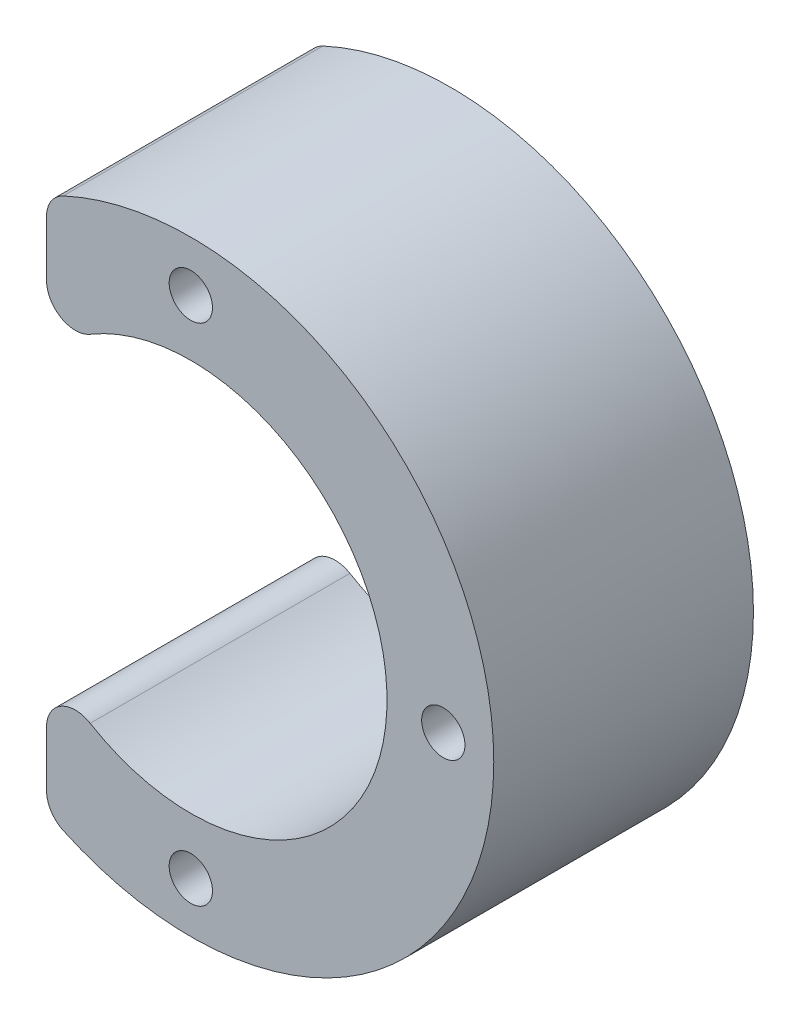
ISO-10303-21;
HEADER;
FILE_DESCRIPTION(('STEP AP214'),'2;1');
FILE_NAME('part.step','',(''),(''),'','','');
FILE_SCHEMA(('AUTOMOTIVE_DESIGN { 1 0 10303 214 1 1 1 1 }'));
ENDSEC;
DATA;
#1=APPLICATION_CONTEXT('core data for automotive mechanical design processes');
#2=APPLICATION_PROTOCOL_DEFINITION('international standard','automotive_design',2000,#1);
#3=PRODUCT_CONTEXT('',#1,'mechanical');
#4=PRODUCT('Part','Part','',(#3));
#5=PRODUCT_RELATED_PRODUCT_CATEGORY('part','',(#4));
#6=PRODUCT_DEFINITION_FORMATION('','',#4);
#7=PRODUCT_DEFINITION_CONTEXT('part definition',#1,'design');
#8=PRODUCT_DEFINITION('design','',#6,#7);
#9=PRODUCT_DEFINITION_SHAPE('','',#8);
#10=(LENGTH_UNIT() NAMED_UNIT(*) SI_UNIT(.MILLI.,.METRE.));
#11=(NAMED_UNIT(*) PLANE_ANGLE_UNIT() SI_UNIT($,.RADIAN.));
#12=(NAMED_UNIT(*) SI_UNIT($,.STERADIAN.) SOLID_ANGLE_UNIT());
#13=UNCERTAINTY_MEASURE_WITH_UNIT(LENGTH_MEASURE(1.E-05),#10,'distance_accuracy_value','');
#14=(GEOMETRIC_REPRESENTATION_CONTEXT(3) GLOBAL_UNCERTAINTY_ASSIGNED_CONTEXT((#13)) GLOBAL_UNIT_ASSIGNED_CONTEXT((#10,
#11,#12)) REPRESENTATION_CONTEXT('',''));
#15=CARTESIAN_POINT('',(0.,0.,0.));
#16=DIRECTION('',(0.,0.,1.));
#17=DIRECTION('',(1.,0.,0.));
#18=AXIS2_PLACEMENT_3D('',#15,#16,#17);
#19=CARTESIAN_POINT('',(0.,0.,18.));
#20=DIRECTION('',(0.,0.,-1.));
#21=DIRECTION('',(-1.,0.,0.));
#22=AXIS2_PLACEMENT_3D('',#19,#20,#21);
#23=CYLINDRICAL_SURFACE('',#22,21.);
#24=CARTESIAN_POINT('',(0.,0.,0.));
#25=DIRECTION('',(0.,0.,1.));
#26=DIRECTION('',(1.,0.,0.));
#27=AXIS2_PLACEMENT_3D('',#24,#25,#26);
#28=CIRCLE('',#27,21.);
#29=CARTESIAN_POINT('',(-8.8421052631579,-19.0477603543103,0.));
#30=VERTEX_POINT('',#29);
#31=CARTESIAN_POINT('',(-8.84210526315789,19.0477603543103,0.));
#32=VERTEX_POINT('',#31);
#33=EDGE_CURVE('E157',#30,#32,#28,.T.);
#34=ORIENTED_EDGE('',*,*,#33,.T.);
#35=DIRECTION('',(0.,0.,-1.));
#36=VECTOR('',#35,1.);
#37=CARTESIAN_POINT('',(-8.8421052631579,19.0477603543103,18.));
#38=LINE('',#37,#36);
#39=CARTESIAN_POINT('',(-8.84210526315789,19.0477603543103,18.));
#40=VERTEX_POINT('',#39);
#41=EDGE_CURVE('E129',#32,#40,#38,.F.);
#42=ORIENTED_EDGE('',*,*,#41,.T.);
#43=CARTESIAN_POINT('',(0.,0.,18.));
#44=DIRECTION('',(0.,0.,1.));
#45=DIRECTION('',(1.,0.,0.));
#46=AXIS2_PLACEMENT_3D('',#43,#44,#45);
#47=CIRCLE('',#46,21.);
#48=CARTESIAN_POINT('',(-8.8421052631579,-19.0477603543103,18.));
#49=VERTEX_POINT('',#48);
#50=EDGE_CURVE('E114',#49,#40,#47,.T.);
#51=ORIENTED_EDGE('',*,*,#50,.F.);
#52=DIRECTION('',(0.,0.,-1.));
#53=VECTOR('',#52,1.);
#54=CARTESIAN_POINT('',(-8.8421052631579,-19.0477603543103,18.));
#55=LINE('',#54,#53);
#56=EDGE_CURVE('E177',#49,#30,#55,.T.);
#57=ORIENTED_EDGE('',*,*,#56,.T.);
#58=EDGE_LOOP('',(#34,#42,#51,#57));
#59=FACE_BOUND('',#58,.T.);
#60=ADVANCED_FACE('F36',(#59),#23,.T.);
#61=CARTESIAN_POINT('',(0.,0.,18.));
#62=DIRECTION('',(0.,0.,1.));
#63=DIRECTION('',(1.,0.,0.));
#64=AXIS2_PLACEMENT_3D('',#61,#62,#63);
#65=PLANE('',#64);
#66=ORIENTED_EDGE('',*,*,#50,.T.);
#67=CARTESIAN_POINT('',(-8.,17.2336879396141,18.));
#68=DIRECTION('',(0.,0.,1.));
#69=DIRECTION('',(1.,0.,0.));
#70=AXIS2_PLACEMENT_3D('',#67,#68,#69);
#71=CIRCLE('',#70,2.);
#72=CARTESIAN_POINT('',(-10.,17.2336879396141,18.));
#73=VERTEX_POINT('',#72);
#74=EDGE_CURVE('E120',#40,#73,#71,.T.);
#75=ORIENTED_EDGE('',*,*,#74,.T.);
#76=DIRECTION('',(0.,1.,0.));
#77=VECTOR('',#76,1.);
#78=CARTESIAN_POINT('',(-10.,0.,18.));
#79=LINE('',#78,#77);
#80=CARTESIAN_POINT('',(-10.,13.3925352342266,18.));
#81=VERTEX_POINT('',#80);
#82=EDGE_CURVE('E108',#81,#73,#79,.T.);
#83=ORIENTED_EDGE('',*,*,#82,.F.);
#84=CARTESIAN_POINT('',(-8.,13.3925352342266,18.));
#85=DIRECTION('',(0.,0.,1.));
#86=DIRECTION('',(1.,0.,0.));
#87=AXIS2_PLACEMENT_3D('',#84,#85,#86);
#88=CIRCLE('',#87,2.);
#89=CARTESIAN_POINT('',(-6.97435897435897,11.6755435375309,18.));
#90=VERTEX_POINT('',#89);
#91=EDGE_CURVE('E51',#81,#90,#88,.T.);
#92=ORIENTED_EDGE('',*,*,#91,.T.);
#93=CARTESIAN_POINT('',(0.,0.,18.));
#94=DIRECTION('',(0.,0.,1.));
#95=DIRECTION('',(1.,0.,0.));
#96=AXIS2_PLACEMENT_3D('',#93,#94,#95);
#97=CIRCLE('',#96,13.6);
#98=CARTESIAN_POINT('',(-6.97435897435898,-11.6755435375308,18.));
#99=VERTEX_POINT('',#98);
#100=EDGE_CURVE('E140',#99,#90,#97,.T.);
#101=ORIENTED_EDGE('',*,*,#100,.F.);
#102=CARTESIAN_POINT('',(-8.,-13.3925352342266,18.));
#103=DIRECTION('',(0.,0.,1.));
#104=DIRECTION('',(1.,0.,0.));
#105=AXIS2_PLACEMENT_3D('',#102,#103,#104);
#106=CIRCLE('',#105,2.);
#107=CARTESIAN_POINT('',(-10.,-13.3925352342266,18.));
#108=VERTEX_POINT('',#107);
#109=EDGE_CURVE('E59',#99,#108,#106,.T.);
#110=ORIENTED_EDGE('',*,*,#109,.T.);
#111=CARTESIAN_POINT('',(-10.,-17.2336879396141,18.));
#112=VERTEX_POINT('',#111);
#113=EDGE_CURVE('E122',#112,#108,#79,.T.);
#114=ORIENTED_EDGE('',*,*,#113,.F.);
#115=CARTESIAN_POINT('',(-8.,-17.2336879396141,18.));
#116=DIRECTION('',(0.,0.,1.));
#117=DIRECTION('',(1.,0.,0.));
#118=AXIS2_PLACEMENT_3D('',#115,#116,#117);
#119=CIRCLE('',#118,2.);
#120=EDGE_CURVE('E126',#112,#49,#119,.T.);
#121=ORIENTED_EDGE('',*,*,#120,.T.);
#122=EDGE_LOOP('',(#66,#75,#83,#92,#101,#110,#114,#121));
#123=FACE_BOUND('',#122,.T.);
#124=CARTESIAN_POINT('',(-1.19118001678123E-13,-17.5,18.));
#125=DIRECTION('',(0.,0.,1.));
#126=DIRECTION('',(1.,0.,0.));
#127=AXIS2_PLACEMENT_3D('',#124,#125,#126);
#128=CIRCLE('',#127,1.5);
#129=CARTESIAN_POINT('',(1.49999999999988,-17.5,18.));
#130=VERTEX_POINT('',#129);
#131=EDGE_CURVE('E121',#130,#130,#128,.T.);
#132=ORIENTED_EDGE('',*,*,#131,.F.);
#133=EDGE_LOOP('',(#132));
#134=FACE_BOUND('',#133,.T.);
#135=CARTESIAN_POINT('',(17.5,0.,18.));
#136=DIRECTION('',(0.,0.,1.));
#137=DIRECTION('',(1.,0.,0.));
#138=AXIS2_PLACEMENT_3D('',#135,#136,#137);
#139=CIRCLE('',#138,1.5);
#140=CARTESIAN_POINT('',(19.,0.,18.));
#141=VERTEX_POINT('',#140);
#142=EDGE_CURVE('E151',#141,#141,#139,.T.);
#143=ORIENTED_EDGE('',*,*,#142,.F.);
#144=EDGE_LOOP('',(#143));
#145=FACE_BOUND('',#144,.T.);
#146=CARTESIAN_POINT('',(0.,17.5,18.));
#147=DIRECTION('',(0.,0.,1.));
#148=DIRECTION('',(1.,0.,0.));
#149=AXIS2_PLACEMENT_3D('',#146,#147,#148);
#150=CIRCLE('',#149,1.5);
#151=CARTESIAN_POINT('',(1.49999999999999,17.5,18.));
#152=VERTEX_POINT('',#151);
#153=EDGE_CURVE('E146',#152,#152,#150,.T.);
#154=ORIENTED_EDGE('',*,*,#153,.F.);
#155=EDGE_LOOP('',(#154));
#156=FACE_BOUND('',#155,.T.);
#157=ADVANCED_FACE('F117',(#123,#134,#145,#156),#65,.T.);
#158=CARTESIAN_POINT('',(0.,0.,0.));
#159=DIRECTION('',(0.,0.,1.));
#160=DIRECTION('',(1.,0.,0.));
#161=AXIS2_PLACEMENT_3D('',#158,#159,#160);
#162=PLANE('',#161);
#163=CARTESIAN_POINT('',(-1.19118001678123E-13,-17.5,0.));
#164=DIRECTION('',(0.,0.,1.));
#165=DIRECTION('',(1.,0.,0.));
#166=AXIS2_PLACEMENT_3D('',#163,#164,#165);
#167=CIRCLE('',#166,1.5);
#168=CARTESIAN_POINT('',(1.49999999999988,-17.5,0.));
#169=VERTEX_POINT('',#168);
#170=EDGE_CURVE('E159',#169,#169,#167,.T.);
#171=ORIENTED_EDGE('',*,*,#170,.T.);
#172=EDGE_LOOP('',(#171));
#173=FACE_BOUND('',#172,.T.);
#174=CARTESIAN_POINT('',(17.5,0.,0.));
#175=DIRECTION('',(0.,0.,1.));
#176=DIRECTION('',(1.,0.,0.));
#177=AXIS2_PLACEMENT_3D('',#174,#175,#176);
#178=CIRCLE('',#177,1.5);
#179=CARTESIAN_POINT('',(19.,0.,0.));
#180=VERTEX_POINT('',#179);
#181=EDGE_CURVE('E163',#180,#180,#178,.T.);
#182=ORIENTED_EDGE('',*,*,#181,.T.);
#183=EDGE_LOOP('',(#182));
#184=FACE_BOUND('',#183,.T.);
#185=CARTESIAN_POINT('',(0.,17.5,0.));
#186=DIRECTION('',(0.,0.,1.));
#187=DIRECTION('',(1.,0.,0.));
#188=AXIS2_PLACEMENT_3D('',#185,#186,#187);
#189=CIRCLE('',#188,1.5);
#190=CARTESIAN_POINT('',(1.49999999999999,17.5,0.));
#191=VERTEX_POINT('',#190);
#192=EDGE_CURVE('E148',#191,#191,#189,.T.);
#193=ORIENTED_EDGE('',*,*,#192,.T.);
#194=EDGE_LOOP('',(#193));
#195=FACE_BOUND('',#194,.T.);
#196=DIRECTION('',(0.,-1.,0.));
#197=VECTOR('',#196,1.);
#198=CARTESIAN_POINT('',(-10.,18.4661853126194,0.));
#199=LINE('',#198,#197);
#200=CARTESIAN_POINT('',(-10.,17.2336879396141,0.));
#201=VERTEX_POINT('',#200);
#202=CARTESIAN_POINT('',(-10.,13.3925352342266,0.));
#203=VERTEX_POINT('',#202);
#204=EDGE_CURVE('E111',#201,#203,#199,.T.);
#205=ORIENTED_EDGE('',*,*,#204,.F.);
#206=CARTESIAN_POINT('',(-8.,17.2336879396141,0.));
#207=DIRECTION('',(0.,0.,1.));
#208=DIRECTION('',(1.,0.,0.));
#209=AXIS2_PLACEMENT_3D('',#206,#207,#208);
#210=CIRCLE('',#209,2.);
#211=EDGE_CURVE('E175',#201,#32,#210,.F.);
#212=ORIENTED_EDGE('',*,*,#211,.T.);
#213=ORIENTED_EDGE('',*,*,#33,.F.);
#214=CARTESIAN_POINT('',(-8.,-17.2336879396141,0.));
#215=DIRECTION('',(0.,0.,1.));
#216=DIRECTION('',(1.,0.,0.));
#217=AXIS2_PLACEMENT_3D('',#214,#215,#216);
#218=CIRCLE('',#217,2.);
#219=CARTESIAN_POINT('',(-10.,-17.2336879396141,0.));
#220=VERTEX_POINT('',#219);
#221=EDGE_CURVE('E173',#30,#220,#218,.F.);
#222=ORIENTED_EDGE('',*,*,#221,.T.);
#223=CARTESIAN_POINT('',(-10.,-13.3925352342266,0.));
#224=VERTEX_POINT('',#223);
#225=EDGE_CURVE('E189',#224,#220,#199,.T.);
#226=ORIENTED_EDGE('',*,*,#225,.F.);
#227=CARTESIAN_POINT('',(-8.,-13.3925352342266,0.));
#228=DIRECTION('',(0.,0.,1.));
#229=DIRECTION('',(1.,0.,0.));
#230=AXIS2_PLACEMENT_3D('',#227,#228,#229);
#231=CIRCLE('',#230,2.);
#232=CARTESIAN_POINT('',(-6.97435897435898,-11.6755435375308,0.));
#233=VERTEX_POINT('',#232);
#234=EDGE_CURVE('E169',#224,#233,#231,.F.);
#235=ORIENTED_EDGE('',*,*,#234,.T.);
#236=CARTESIAN_POINT('',(0.,0.,0.));
#237=DIRECTION('',(0.,0.,1.));
#238=DIRECTION('',(1.,0.,0.));
#239=AXIS2_PLACEMENT_3D('',#236,#237,#238);
#240=CIRCLE('',#239,13.6);
#241=CARTESIAN_POINT('',(-6.97435897435897,11.6755435375309,0.));
#242=VERTEX_POINT('',#241);
#243=EDGE_CURVE('E142',#233,#242,#240,.T.);
#244=ORIENTED_EDGE('',*,*,#243,.T.);
#245=CARTESIAN_POINT('',(-8.,13.3925352342266,0.));
#246=DIRECTION('',(0.,0.,1.));
#247=DIRECTION('',(1.,0.,0.));
#248=AXIS2_PLACEMENT_3D('',#245,#246,#247);
#249=CIRCLE('',#248,2.);
#250=EDGE_CURVE('E171',#242,#203,#249,.F.);
#251=ORIENTED_EDGE('',*,*,#250,.T.);
#252=EDGE_LOOP('',(#205,#212,#213,#222,#226,#235,#244,#251));
#253=FACE_BOUND('',#252,.T.);
#254=ADVANCED_FACE('F188',(#173,#184,#195,#253),#162,.F.);
#255=CARTESIAN_POINT('',(0.,0.,-7.));
#256=DIRECTION('',(0.,0.,1.));
#257=DIRECTION('',(1.,0.,0.));
#258=AXIS2_PLACEMENT_3D('',#255,#256,#257);
#259=CYLINDRICAL_SURFACE('',#258,13.6);
#260=ORIENTED_EDGE('',*,*,#100,.T.);
#261=DIRECTION('',(0.,0.,1.));
#262=VECTOR('',#261,1.);
#263=CARTESIAN_POINT('',(-6.97435897435897,11.6755435375309,-7.));
#264=LINE('',#263,#262);
#265=EDGE_CURVE('E11',#90,#242,#264,.F.);
#266=ORIENTED_EDGE('',*,*,#265,.T.);
#267=ORIENTED_EDGE('',*,*,#243,.F.);
#268=DIRECTION('',(0.,0.,1.));
#269=VECTOR('',#268,1.);
#270=CARTESIAN_POINT('',(-6.97435897435898,-11.6755435375308,-7.));
#271=LINE('',#270,#269);
#272=EDGE_CURVE('E44',#233,#99,#271,.T.);
#273=ORIENTED_EDGE('',*,*,#272,.T.);
#274=EDGE_LOOP('',(#260,#266,#267,#273));
#275=FACE_BOUND('',#274,.T.);
#276=ADVANCED_FACE('F139',(#275),#259,.F.);
#277=CARTESIAN_POINT('',(0.,17.5,-7.));
#278=DIRECTION('',(0.,0.,1.));
#279=DIRECTION('',(1.,0.,0.));
#280=AXIS2_PLACEMENT_3D('',#277,#278,#279);
#281=CYLINDRICAL_SURFACE('',#280,1.5);
#282=ORIENTED_EDGE('',*,*,#153,.T.);
#283=EDGE_LOOP('',(#282));
#284=FACE_BOUND('',#283,.T.);
#285=ORIENTED_EDGE('',*,*,#192,.F.);
#286=EDGE_LOOP('',(#285));
#287=FACE_BOUND('',#286,.T.);
#288=ADVANCED_FACE('F206',(#284,#287),#281,.F.);
#289=CARTESIAN_POINT('',(17.5,0.,-7.));
#290=DIRECTION('',(0.,0.,1.));
#291=DIRECTION('',(1.,0.,0.));
#292=AXIS2_PLACEMENT_3D('',#289,#290,#291);
#293=CYLINDRICAL_SURFACE('',#292,1.5);
#294=ORIENTED_EDGE('',*,*,#142,.T.);
#295=EDGE_LOOP('',(#294));
#296=FACE_BOUND('',#295,.T.);
#297=ORIENTED_EDGE('',*,*,#181,.F.);
#298=EDGE_LOOP('',(#297));
#299=FACE_BOUND('',#298,.T.);
#300=ADVANCED_FACE('F209',(#296,#299),#293,.F.);
#301=CARTESIAN_POINT('',(-1.19118001678123E-13,-17.5,-7.));
#302=DIRECTION('',(0.,0.,1.));
#303=DIRECTION('',(1.,0.,0.));
#304=AXIS2_PLACEMENT_3D('',#301,#302,#303);
#305=CYLINDRICAL_SURFACE('',#304,1.5);
#306=ORIENTED_EDGE('',*,*,#131,.T.);
#307=EDGE_LOOP('',(#306));
#308=FACE_BOUND('',#307,.T.);
#309=ORIENTED_EDGE('',*,*,#170,.F.);
#310=EDGE_LOOP('',(#309));
#311=FACE_BOUND('',#310,.T.);
#312=ADVANCED_FACE('F198',(#308,#311),#305,.F.);
#313=CARTESIAN_POINT('',(-10.,18.4661853126194,25.));
#314=DIRECTION('',(1.,0.,0.));
#315=DIRECTION('',(0.,1.,0.));
#316=AXIS2_PLACEMENT_3D('',#313,#314,#315);
#317=PLANE('',#316);
#318=ORIENTED_EDGE('',*,*,#225,.T.);
#319=DIRECTION('',(0.,0.,-1.));
#320=VECTOR('',#319,1.);
#321=CARTESIAN_POINT('',(-10.,-17.2336879396141,25.));
#322=LINE('',#321,#320);
#323=EDGE_CURVE('E136',#220,#112,#322,.F.);
#324=ORIENTED_EDGE('',*,*,#323,.T.);
#325=ORIENTED_EDGE('',*,*,#113,.T.);
#326=DIRECTION('',(0.,0.,1.));
#327=VECTOR('',#326,1.);
#328=CARTESIAN_POINT('',(-10.,-13.3925352342266,25.));
#329=LINE('',#328,#327);
#330=EDGE_CURVE('E134',#108,#224,#329,.F.);
#331=ORIENTED_EDGE('',*,*,#330,.T.);
#332=EDGE_LOOP('',(#318,#324,#325,#331));
#333=FACE_BOUND('',#332,.T.);
#334=ADVANCED_FACE('F240',(#333),#317,.F.);
#335=ORIENTED_EDGE('',*,*,#82,.T.);
#336=DIRECTION('',(0.,0.,-1.));
#337=VECTOR('',#336,1.);
#338=CARTESIAN_POINT('',(-10.,17.2336879396141,25.));
#339=LINE('',#338,#337);
#340=EDGE_CURVE('E113',#73,#201,#339,.T.);
#341=ORIENTED_EDGE('',*,*,#340,.T.);
#342=ORIENTED_EDGE('',*,*,#204,.T.);
#343=DIRECTION('',(0.,0.,1.));
#344=VECTOR('',#343,1.);
#345=CARTESIAN_POINT('',(-10.,13.3925352342266,25.));
#346=LINE('',#345,#344);
#347=EDGE_CURVE('E105',#203,#81,#346,.T.);
#348=ORIENTED_EDGE('',*,*,#347,.T.);
#349=EDGE_LOOP('',(#335,#341,#342,#348));
#350=FACE_BOUND('',#349,.T.);
#351=ADVANCED_FACE('F106',(#350),#317,.F.);
#352=CARTESIAN_POINT('',(-8.,17.2336879396141,18.));
#353=DIRECTION('',(0.,0.,-1.));
#354=DIRECTION('',(-1.,0.,0.));
#355=AXIS2_PLACEMENT_3D('',#352,#353,#354);
#356=CYLINDRICAL_SURFACE('',#355,2.);
#357=ORIENTED_EDGE('',*,*,#74,.F.);
#358=ORIENTED_EDGE('',*,*,#41,.F.);
#359=ORIENTED_EDGE('',*,*,#211,.F.);
#360=ORIENTED_EDGE('',*,*,#340,.F.);
#361=EDGE_LOOP('',(#357,#358,#359,#360));
#362=FACE_BOUND('',#361,.T.);
#363=ADVANCED_FACE('F186',(#362),#356,.T.);
#364=CARTESIAN_POINT('',(-8.,-17.2336879396141,18.));
#365=DIRECTION('',(0.,0.,-1.));
#366=DIRECTION('',(-1.,0.,0.));
#367=AXIS2_PLACEMENT_3D('',#364,#365,#366);
#368=CYLINDRICAL_SURFACE('',#367,2.);
#369=ORIENTED_EDGE('',*,*,#120,.F.);
#370=ORIENTED_EDGE('',*,*,#323,.F.);
#371=ORIENTED_EDGE('',*,*,#221,.F.);
#372=ORIENTED_EDGE('',*,*,#56,.F.);
#373=EDGE_LOOP('',(#369,#370,#371,#372));
#374=FACE_BOUND('',#373,.T.);
#375=ADVANCED_FACE('F228',(#374),#368,.T.);
#376=CARTESIAN_POINT('',(-8.,13.3925352342266,-7.));
#377=DIRECTION('',(0.,0.,1.));
#378=DIRECTION('',(1.,0.,0.));
#379=AXIS2_PLACEMENT_3D('',#376,#377,#378);
#380=CYLINDRICAL_SURFACE('',#379,2.);
#381=ORIENTED_EDGE('',*,*,#91,.F.);
#382=ORIENTED_EDGE('',*,*,#347,.F.);
#383=ORIENTED_EDGE('',*,*,#250,.F.);
#384=ORIENTED_EDGE('',*,*,#265,.F.);
#385=EDGE_LOOP('',(#381,#382,#383,#384));
#386=FACE_BOUND('',#385,.T.);
#387=ADVANCED_FACE('F125',(#386),#380,.T.);
#388=CARTESIAN_POINT('',(-8.,-13.3925352342266,-7.));
#389=DIRECTION('',(0.,0.,1.));
#390=DIRECTION('',(1.,0.,0.));
#391=AXIS2_PLACEMENT_3D('',#388,#389,#390);
#392=CYLINDRICAL_SURFACE('',#391,2.);
#393=ORIENTED_EDGE('',*,*,#234,.F.);
#394=ORIENTED_EDGE('',*,*,#330,.F.);
#395=ORIENTED_EDGE('',*,*,#109,.F.);
#396=ORIENTED_EDGE('',*,*,#272,.F.);
#397=EDGE_LOOP('',(#393,#394,#395,#396));
#398=FACE_BOUND('',#397,.T.);
#399=ADVANCED_FACE('F38',(#398),#392,.T.);
#400=CLOSED_SHELL('',(#60,#157,#254,#276,#288,#300,#312,#334,#351,#363,#375,#387,#399));
#401=MANIFOLD_SOLID_BREP('B2',#400);
#402=ADVANCED_BREP_SHAPE_REPRESENTATION('',(#18,#401),#14);
#403=SHAPE_DEFINITION_REPRESENTATION(#9,#402);
ENDSEC;
END-ISO-10303-21;
